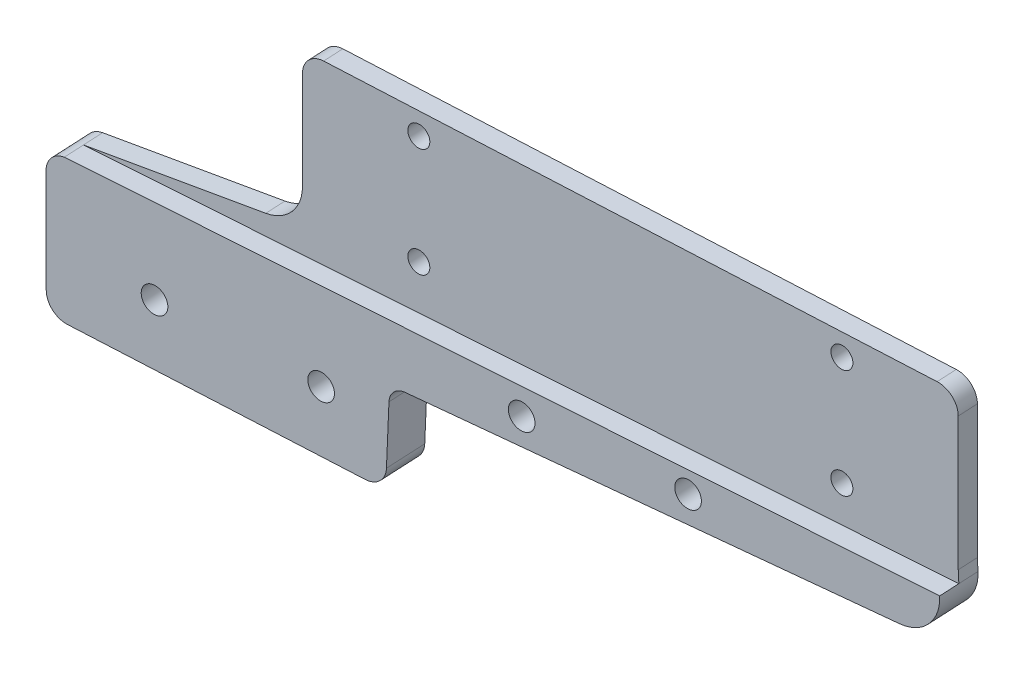
ISO-10303-21;
HEADER;
FILE_DESCRIPTION(('STEP AP214'),'2;1');
FILE_NAME('part.step','',(''),(''),'','','');
FILE_SCHEMA(('AUTOMOTIVE_DESIGN { 1 0 10303 214 1 1 1 1 }'));
ENDSEC;
DATA;
#1=APPLICATION_CONTEXT('core data for automotive mechanical design processes');
#2=APPLICATION_PROTOCOL_DEFINITION('international standard','automotive_design',2000,#1);
#3=PRODUCT_CONTEXT('',#1,'mechanical');
#4=PRODUCT('Part','Part','',(#3));
#5=PRODUCT_RELATED_PRODUCT_CATEGORY('part','',(#4));
#6=PRODUCT_DEFINITION_FORMATION('','',#4);
#7=PRODUCT_DEFINITION_CONTEXT('part definition',#1,'design');
#8=PRODUCT_DEFINITION('design','',#6,#7);
#9=PRODUCT_DEFINITION_SHAPE('','',#8);
#10=(LENGTH_UNIT() NAMED_UNIT(*) SI_UNIT(.MILLI.,.METRE.));
#11=(NAMED_UNIT(*) PLANE_ANGLE_UNIT() SI_UNIT($,.RADIAN.));
#12=(NAMED_UNIT(*) SI_UNIT($,.STERADIAN.) SOLID_ANGLE_UNIT());
#13=UNCERTAINTY_MEASURE_WITH_UNIT(LENGTH_MEASURE(1.E-05),#10,'distance_accuracy_value','');
#14=(GEOMETRIC_REPRESENTATION_CONTEXT(3) GLOBAL_UNCERTAINTY_ASSIGNED_CONTEXT((#13)) GLOBAL_UNIT_ASSIGNED_CONTEXT((#10,
#11,#12)) REPRESENTATION_CONTEXT('',''));
#15=CARTESIAN_POINT('',(0.,0.,0.));
#16=DIRECTION('',(0.,0.,1.));
#17=DIRECTION('',(1.,0.,0.));
#18=AXIS2_PLACEMENT_3D('',#15,#16,#17);
#19=CARTESIAN_POINT('',(23.0304524303552,-45.5135044544034,48.0957868389606));
#20=DIRECTION('',(-0.0496451578909029,0.,-0.9987669189045));
#21=DIRECTION('',(-0.9987669189045,0.,0.0496451578909029));
#22=AXIS2_PLACEMENT_3D('',#19,#20,#21);
#23=PLANE('',#22);
#24=CARTESIAN_POINT('',(-4.7239604871679,-38.0288662319544,49.4753601762225));
#25=DIRECTION('',(0.049645157890903,0.,0.9987669189045));
#26=DIRECTION('',(0.998658141309086,0.0147584526092087,-0.0496397509427982));
#27=AXIS2_PLACEMENT_3D('',#24,#25,#26);
#28=CIRCLE('',#27,3.29999975);
#29=CARTESIAN_POINT('',(-8.01953210382338,-38.0775691218753,49.6391713419236));
#30=VERTEX_POINT('',#29);
#31=EDGE_CURVE('E321',#30,#30,#28,.T.);
#32=ORIENTED_EDGE('',*,*,#31,.T.);
#33=EDGE_LOOP('',(#32));
#34=FACE_BOUND('',#33,.T.);
#35=CARTESIAN_POINT('',(-4.72396048717242,-3.73886623195444,49.4753601762225));
#36=DIRECTION('',(0.049645157890903,0.,0.9987669189045));
#37=DIRECTION('',(0.998658141309086,0.0147584526092074,-0.0496397509427982));
#38=AXIS2_PLACEMENT_3D('',#35,#36,#37);
#39=CIRCLE('',#38,3.29999975);
#40=CARTESIAN_POINT('',(-8.01953210382787,-3.78756912187521,49.6391713419238));
#41=VERTEX_POINT('',#40);
#42=EDGE_CURVE('E213',#41,#41,#39,.T.);
#43=ORIENTED_EDGE('',*,*,#42,.T.);
#44=EDGE_LOOP('',(#43));
#45=FACE_BOUND('',#44,.T.);
#46=CARTESIAN_POINT('',(122.119438213698,-38.0288662319437,43.1704251240779));
#47=DIRECTION('',(0.049645157890903,0.,0.9987669189045));
#48=DIRECTION('',(0.998658141309086,0.0147584526092084,-0.0496397509427982));
#49=AXIS2_PLACEMENT_3D('',#46,#47,#48);
#50=CIRCLE('',#49,3.29999975);
#51=CARTESIAN_POINT('',(118.823866597042,-38.0775691218644,43.3342362897793));
#52=VERTEX_POINT('',#51);
#53=EDGE_CURVE('E215',#52,#52,#50,.T.);
#54=ORIENTED_EDGE('',*,*,#53,.T.);
#55=EDGE_LOOP('',(#54));
#56=FACE_BOUND('',#55,.T.);
#57=CARTESIAN_POINT('',(122.119438213699,-3.7388662319316,43.1704251240779));
#58=DIRECTION('',(0.049645157890903,0.,0.9987669189045));
#59=DIRECTION('',(0.998658141309086,0.0147584526092087,-0.0496397509427982));
#60=AXIS2_PLACEMENT_3D('',#57,#58,#59);
#61=CIRCLE('',#60,3.29999975);
#62=CARTESIAN_POINT('',(118.823866597043,-3.78756912185237,43.3342362897793));
#63=VERTEX_POINT('',#62);
#64=EDGE_CURVE('E298',#63,#63,#61,.T.);
#65=ORIENTED_EDGE('',*,*,#64,.T.);
#66=EDGE_LOOP('',(#65));
#67=FACE_BOUND('',#66,.T.);
#68=CARTESIAN_POINT('',(81.7457238699355,-56.9150872381148,45.1772591363986));
#69=DIRECTION('',(0.0496451578909029,0.,0.9987669189045));
#70=DIRECTION('',(0.998748746819008,0.00603230557767858,-0.0496442546210445));
#71=AXIS2_PLACEMENT_3D('',#68,#69,#70);
#72=CIRCLE('',#71,4.0005);
#73=CARTESIAN_POINT('',(77.7502295082861,-56.9392194765781,45.3758609770102));
#74=VERTEX_POINT('',#73);
#75=EDGE_CURVE('E447',#74,#74,#72,.T.);
#76=ORIENTED_EDGE('',*,*,#75,.T.);
#77=EDGE_LOOP('',(#76));
#78=FACE_BOUND('',#77,.T.);
#79=CARTESIAN_POINT('',(-78.226896796319,-79.9764448286637,53.1289302028661));
#80=DIRECTION('',(0.049645157890903,0.,0.9987669189045));
#81=DIRECTION('',(0.997535358297987,0.049645157890903,-0.0495839413852246));
#82=AXIS2_PLACEMENT_3D('',#79,#80,#81);
#83=CIRCLE('',#82,4.0005);
#84=CARTESIAN_POINT('',(-82.21753699719,-80.1750502828063,53.3272907603776));
#85=VERTEX_POINT('',#84);
#86=EDGE_CURVE('E266',#85,#85,#83,.T.);
#87=ORIENTED_EDGE('',*,*,#86,.T.);
#88=EDGE_LOOP('',(#87));
#89=FACE_BOUND('',#88,.T.);
#90=CARTESIAN_POINT('',(-28.2760697725503,-79.8746910733802,50.6460519182148));
#91=DIRECTION('',(0.049645157890903,0.,0.9987669189045));
#92=DIRECTION('',(0.997535358297987,0.049645157890903,-0.0495839413852246));
#93=AXIS2_PLACEMENT_3D('',#90,#91,#92);
#94=CIRCLE('',#93,4.0005);
#95=CARTESIAN_POINT('',(-32.2667099734212,-80.0732965275228,50.8444124757263));
#96=VERTEX_POINT('',#95);
#97=EDGE_CURVE('E242',#96,#96,#94,.T.);
#98=ORIENTED_EDGE('',*,*,#97,.T.);
#99=EDGE_LOOP('',(#98));
#100=FACE_BOUND('',#99,.T.);
#101=CARTESIAN_POINT('',(31.8563870095215,-59.3979706616494,47.6570809633213));
#102=DIRECTION('',(0.0496451578909029,0.,0.9987669189045));
#103=DIRECTION('',(0.998748746819008,0.00603230557767854,-0.0496442546210445));
#104=AXIS2_PLACEMENT_3D('',#101,#102,#103);
#105=CIRCLE('',#104,4.0005);
#106=CARTESIAN_POINT('',(27.8608926478721,-59.4221029001128,47.8556828039329));
#107=VERTEX_POINT('',#106);
#108=EDGE_CURVE('E241',#107,#107,#105,.T.);
#109=ORIENTED_EDGE('',*,*,#108,.T.);
#110=EDGE_LOOP('',(#109));
#111=FACE_BOUND('',#110,.T.);
#112=DIRECTION('',(-0.0407531135449785,-0.999167193369499,0.00202569259973683));
#113=VECTOR('',#112,1.);
#114=CARTESIAN_POINT('',(-8.69104057488795,-92.8068316202381,49.6725496441483));
#115=LINE('',#114,#113);
#116=CARTESIAN_POINT('',(-7.93815013550859,-74.347789800056,49.6351261331867));
#117=VERTEX_POINT('',#116);
#118=CARTESIAN_POINT('',(-8.69104057488795,-92.8068316202381,49.6725496441483));
#119=VERTEX_POINT('',#118);
#120=EDGE_CURVE('E10',#117,#119,#115,.T.);
#121=ORIENTED_EDGE('',*,*,#120,.T.);
#122=CARTESIAN_POINT('',(-15.0279287087578,-92.5477298557401,49.9875338571697));
#123=DIRECTION('',(-0.0496451578909029,0.,-0.9987669189045));
#124=DIRECTION('',(0.997935139192111,-0.0408034274800349,-0.0496038130742391));
#125=AXIS2_PLACEMENT_3D('',#122,#123,#124);
#126=CIRCLE('',#125,6.35);
#127=CARTESIAN_POINT('',(-15.0150251682995,-98.8977167129911,49.9868924679813));
#128=VERTEX_POINT('',#127);
#129=EDGE_CURVE('E312',#119,#128,#126,.T.);
#130=ORIENTED_EDGE('',*,*,#129,.T.);
#131=DIRECTION('',(-0.998764851732424,-0.00203456239592946,0.0496450551391176));
#132=VECTOR('',#131,1.);
#133=CARTESIAN_POINT('',(-104.343240853185,-99.0796852997037,54.4270809522506));
#134=LINE('',#133,#132);
#135=CARTESIAN_POINT('',(-104.343240853185,-99.0796852997037,54.4270809522506));
#136=VERTEX_POINT('',#135);
#137=EDGE_CURVE('E349',#128,#136,#134,.T.);
#138=ORIENTED_EDGE('',*,*,#137,.T.);
#139=CARTESIAN_POINT('',(-104.356144393644,-92.7296984424527,54.427722341439));
#140=DIRECTION('',(-0.0496451578909029,0.,-0.9987669189045));
#141=DIRECTION('',(0.00203205361550425,-0.999997930275787,-0.000101006171384508));
#142=AXIS2_PLACEMENT_3D('',#139,#140,#141);
#143=CIRCLE('',#142,6.35);
#144=CARTESIAN_POINT('',(-110.698301202145,-92.7426179136668,54.7429684415724));
#145=VERTEX_POINT('',#144);
#146=EDGE_CURVE('E235',#136,#145,#143,.T.);
#147=ORIENTED_EDGE('',*,*,#146,.T.);
#148=DIRECTION('',(-0.00203205361550178,0.999997930275787,0.000101006171384386));
#149=VECTOR('',#148,1.);
#150=CARTESIAN_POINT('',(-110.764410892314,-60.2092473194499,54.7462545195796));
#151=LINE('',#150,#149);
#152=CARTESIAN_POINT('',(-110.764410892314,-60.2092473194499,54.7462545195796));
#153=VERTEX_POINT('',#152);
#154=EDGE_CURVE('E236',#145,#153,#151,.T.);
#155=ORIENTED_EDGE('',*,*,#154,.T.);
#156=CARTESIAN_POINT('',(-104.422254083813,-60.1963278482358,54.4310084194462));
#157=DIRECTION('',(-0.049645157890903,0.,-0.9987669189045));
#158=DIRECTION('',(-0.998764851732424,-0.00203456239592075,0.0496450551391176));
#159=AXIS2_PLACEMENT_3D('',#156,#157,#158);
#160=CIRCLE('',#159,6.35);
#161=CARTESIAN_POINT('',(-105.265370410465,-53.9026883167336,54.4729167389596));
#162=VERTEX_POINT('',#161);
#163=EDGE_CURVE('E253',#153,#162,#160,.T.);
#164=ORIENTED_EDGE('',*,*,#163,.T.);
#165=DIRECTION('',(0.98990219898805,0.132938148186988,-0.0492045241338364));
#166=VECTOR('',#165,1.);
#167=CARTESIAN_POINT('',(-50.6040023466961,-46.5619822801238,51.7558941817499));
#168=LINE('',#167,#166);
#169=CARTESIAN_POINT('',(-50.6040023466961,-46.5619822801238,51.7558941817499));
#170=VERTEX_POINT('',#169);
#171=EDGE_CURVE('E254',#162,#170,#168,.T.);
#172=ORIENTED_EDGE('',*,*,#171,.T.);
#173=CARTESIAN_POINT('',(-52.2902350000003,-33.9747032171193,51.8397108207769));
#174=DIRECTION('',(0.0496451578909029,0.,0.9987669189045));
#175=DIRECTION('',(0.9987669189045,0.,-0.0496451578909029));
#176=AXIS2_PLACEMENT_3D('',#173,#174,#175);
#177=CIRCLE('',#176,12.7);
#178=CARTESIAN_POINT('',(-39.6058951299132,-33.9747032171198,51.2092173155625));
#179=VERTEX_POINT('',#178);
#180=EDGE_CURVE('E296',#170,#179,#177,.T.);
#181=ORIENTED_EDGE('',*,*,#180,.T.);
#182=DIRECTION('',(0.,1.,0.));
#183=VECTOR('',#182,1.);
#184=CARTESIAN_POINT('',(-39.6058951299136,-45.085,51.2092173155625));
#185=LINE('',#184,#183);
#186=CARTESIAN_POINT('',(-39.6058951299122,-3.17499999999977,51.2092173155625));
#187=VERTEX_POINT('',#186);
#188=EDGE_CURVE('E297',#179,#187,#185,.T.);
#189=ORIENTED_EDGE('',*,*,#188,.T.);
#190=CARTESIAN_POINT('',(-33.2637251948684,-3.175,50.8939705629551));
#191=DIRECTION('',(-0.0496451578909029,0.,-0.9987669189045));
#192=DIRECTION('',(-0.9987669189045,0.,0.0496451578909029));
#193=AXIS2_PLACEMENT_3D('',#190,#191,#192);
#194=CIRCLE('',#193,6.35);
#195=CARTESIAN_POINT('',(-33.2637251948684,3.175,50.8939705629551));
#196=VERTEX_POINT('',#195);
#197=EDGE_CURVE('E348',#187,#196,#194,.T.);
#198=ORIENTED_EDGE('',*,*,#197,.T.);
#199=DIRECTION('',(0.9987669189045,0.,-0.049645157890903));
#200=VECTOR('',#199,1.);
#201=CARTESIAN_POINT('',(-33.2637251948684,3.175,50.8939705629551));
#202=LINE('',#201,#200);
#203=CARTESIAN_POINT('',(150.659202921395,3.175,41.7518147373452));
#204=VERTEX_POINT('',#203);
#205=EDGE_CURVE('E281',#196,#204,#202,.T.);
#206=ORIENTED_EDGE('',*,*,#205,.T.);
#207=CARTESIAN_POINT('',(150.659202921395,-3.175,41.7518147373452));
#208=DIRECTION('',(-0.0496451578909029,0.,-0.9987669189045));
#209=DIRECTION('',(0.,1.,0.));
#210=AXIS2_PLACEMENT_3D('',#207,#208,#209);
#211=CIRCLE('',#210,6.35);
#212=CARTESIAN_POINT('',(157.001372856439,-3.17500000000025,41.4365679847381));
#213=VERTEX_POINT('',#212);
#214=EDGE_CURVE('E247',#204,#213,#211,.T.);
#215=ORIENTED_EDGE('',*,*,#214,.T.);
#216=DIRECTION('',(0.,-1.,0.));
#217=VECTOR('',#216,1.);
#218=CARTESIAN_POINT('',(157.001372856439,-3.17500000000025,41.4365679847381));
#219=LINE('',#218,#217);
#220=CARTESIAN_POINT('',(157.001372856437,-45.0850000000348,41.4365679847381));
#221=VERTEX_POINT('',#220);
#222=EDGE_CURVE('E248',#213,#221,#219,.T.);
#223=ORIENTED_EDGE('',*,*,#222,.T.);
#224=DIRECTION('',(0.0495839413852198,-0.9987669189045,-0.002464641702012));
#225=VECTOR('',#224,1.);
#226=CARTESIAN_POINT('',(157.001372856437,-45.0850000000348,41.4365679847381));
#227=LINE('',#226,#225);
#228=CARTESIAN_POINT('',(157.185188532275,-48.787590215232,41.4274311600426));
#229=VERTEX_POINT('',#228);
#230=EDGE_CURVE('E360',#221,#229,#227,.T.);
#231=ORIENTED_EDGE('',*,*,#230,.T.);
#232=CARTESIAN_POINT('',(144.516489481891,-49.4180837204464,42.0571472156349));
#233=DIRECTION('',(-0.049645157890903,0.,-0.9987669189045));
#234=DIRECTION('',(0.997535358297987,0.0496451578909028,-0.0495839413852246));
#235=AXIS2_PLACEMENT_3D('',#232,#233,#234);
#236=CIRCLE('',#235,12.7);
#237=CARTESIAN_POINT('',(145.146205537484,-62.1024235905336,42.0258462660195));
#238=VERTEX_POINT('',#237);
#239=EDGE_CURVE('E282',#229,#238,#236,.T.);
#240=ORIENTED_EDGE('',*,*,#239,.T.);
#241=DIRECTION('',(-0.997535358297987,-0.0496451578909023,0.0495839413852246));
#242=VECTOR('',#241,1.);
#243=CARTESIAN_POINT('',(145.146205537484,-62.1024235905336,42.0258462660195));
#244=LINE('',#243,#242);
#245=CARTESIAN_POINT('',(-3.12052605064964,-69.4813352636195,49.395659142616));
#246=VERTEX_POINT('',#245);
#247=EDGE_CURVE('E318',#238,#246,#244,.T.);
#248=ORIENTED_EDGE('',*,*,#247,.T.);
#249=CARTESIAN_POINT('',(-2.86863962841267,-74.5550712116544,49.3831387627695));
#250=DIRECTION('',(0.0496451578909029,0.,0.9987669189045));
#251=DIRECTION('',(-0.997935139192111,0.0408034274800353,0.0496038130742391));
#252=AXIS2_PLACEMENT_3D('',#249,#250,#251);
#253=CIRCLE('',#252,5.08);
#254=EDGE_CURVE('E322',#246,#117,#253,.T.);
#255=ORIENTED_EDGE('',*,*,#254,.T.);
#256=EDGE_LOOP('',(#121,#130,#138,#147,#155,#164,#172,#181,#189,#198,#206,#215,#223,#231,#240,
#248,#255));
#257=FACE_BOUND('',#256,.T.);
#258=ADVANCED_FACE('F15',(#34,#45,#56,#67,#78,#89,#100,#111,#257),#23,.T.);
#259=CARTESIAN_POINT('',(-7.62290338290138,-74.347789800056,55.9772960682304));
#260=DIRECTION('',(0.997935139192111,-0.0408034274800358,-0.0496038130742391));
#261=DIRECTION('',(0.,-0.772287452846569,0.63527324056327));
#262=AXIS2_PLACEMENT_3D('',#259,#260,#261);
#263=PLANE('',#262);
#264=DIRECTION('',(-0.0496451578909029,0.,-0.9987669189045));
#265=VECTOR('',#264,1.);
#266=CARTESIAN_POINT('',(-8.37579382228073,-92.8068316202381,56.0147195791918));
#267=LINE('',#266,#265);
#268=CARTESIAN_POINT('',(-8.06054706967349,-92.8068316202381,62.3568895142355));
#269=VERTEX_POINT('',#268);
#270=EDGE_CURVE('E26',#269,#119,#267,.T.);
#271=ORIENTED_EDGE('',*,*,#270,.T.);
#272=ORIENTED_EDGE('',*,*,#120,.F.);
#273=DIRECTION('',(0.0496451578909029,0.,0.9987669189045));
#274=VECTOR('',#273,1.);
#275=CARTESIAN_POINT('',(-7.62290338290138,-74.347789800056,55.9772960682304));
#276=LINE('',#275,#274);
#277=CARTESIAN_POINT('',(-7.30765663029414,-74.347789800056,62.3194660032739));
#278=VERTEX_POINT('',#277);
#279=EDGE_CURVE('E326',#117,#278,#276,.T.);
#280=ORIENTED_EDGE('',*,*,#279,.T.);
#281=DIRECTION('',(0.0407531135449785,0.999167193369499,-0.00202569259973683));
#282=VECTOR('',#281,1.);
#283=CARTESIAN_POINT('',(-8.06054706967349,-92.8068316202381,62.3568895142355));
#284=LINE('',#283,#282);
#285=EDGE_CURVE('E399',#269,#278,#284,.T.);
#286=ORIENTED_EDGE('',*,*,#285,.F.);
#287=EDGE_LOOP('',(#271,#272,#280,#286));
#288=FACE_BOUND('',#287,.T.);
#289=ADVANCED_FACE('F547',(#288),#263,.T.);
#290=CARTESIAN_POINT('',(-14.7126819561506,-92.5477298557401,56.3297037922132));
#291=DIRECTION('',(-0.0496451578909029,0.,-0.9987669189045));
#292=DIRECTION('',(0.997935139192111,-0.0408034274800349,-0.0496038130742391));
#293=AXIS2_PLACEMENT_3D('',#290,#291,#292);
#294=CYLINDRICAL_SURFACE('',#293,6.35);
#295=DIRECTION('',(-0.0496451578909029,0.,-0.9987669189045));
#296=VECTOR('',#295,1.);
#297=CARTESIAN_POINT('',(-14.6997784156922,-98.8977167129911,56.329062403025));
#298=LINE('',#297,#296);
#299=CARTESIAN_POINT('',(-14.384531663085,-98.8977167129911,62.6712323380685));
#300=VERTEX_POINT('',#299);
#301=EDGE_CURVE('E352',#300,#128,#298,.T.);
#302=ORIENTED_EDGE('',*,*,#301,.T.);
#303=ORIENTED_EDGE('',*,*,#129,.F.);
#304=ORIENTED_EDGE('',*,*,#270,.F.);
#305=CARTESIAN_POINT('',(-14.3974352035434,-92.5477298557401,62.6718737272569));
#306=DIRECTION('',(0.0496451578909029,0.,0.9987669189045));
#307=DIRECTION('',(0.997935139192111,-0.0408034274800349,-0.0496038130742391));
#308=AXIS2_PLACEMENT_3D('',#305,#306,#307);
#309=CIRCLE('',#308,6.35);
#310=EDGE_CURVE('E354',#300,#269,#309,.T.);
#311=ORIENTED_EDGE('',*,*,#310,.F.);
#312=EDGE_LOOP('',(#302,#303,#304,#311));
#313=FACE_BOUND('',#312,.T.);
#314=ADVANCED_FACE('F548',(#313),#294,.T.);
#315=CARTESIAN_POINT('',(-14.6997784156922,-98.8977167129911,56.329062403025));
#316=DIRECTION('',(0.00203205361550144,-0.999997930275787,-0.000101006171384369));
#317=DIRECTION('',(0.,0.000101006379924472,-0.999999994898856));
#318=AXIS2_PLACEMENT_3D('',#315,#316,#317);
#319=PLANE('',#318);
#320=DIRECTION('',(-0.0496451578909029,0.,-0.9987669189045));
#321=VECTOR('',#320,1.);
#322=CARTESIAN_POINT('',(-104.027994100578,-99.0796852997037,60.7692508872943));
#323=LINE('',#322,#321);
#324=CARTESIAN_POINT('',(-103.712747347971,-99.0796852997037,67.1114208223377));
#325=VERTEX_POINT('',#324);
#326=EDGE_CURVE('E353',#325,#136,#323,.T.);
#327=ORIENTED_EDGE('',*,*,#326,.T.);
#328=ORIENTED_EDGE('',*,*,#137,.F.);
#329=ORIENTED_EDGE('',*,*,#301,.F.);
#330=DIRECTION('',(0.998764851732424,0.00203456239592946,-0.0496450551391176));
#331=VECTOR('',#330,1.);
#332=CARTESIAN_POINT('',(-103.712747347971,-99.0796852997037,67.1114208223377));
#333=LINE('',#332,#331);
#334=EDGE_CURVE('E339',#325,#300,#333,.T.);
#335=ORIENTED_EDGE('',*,*,#334,.F.);
#336=EDGE_LOOP('',(#327,#328,#329,#335));
#337=FACE_BOUND('',#336,.T.);
#338=ADVANCED_FACE('F490',(#337),#319,.T.);
#339=CARTESIAN_POINT('',(-104.040897641037,-92.7296984424527,60.7698922764824));
#340=DIRECTION('',(-0.0496451578909029,0.,-0.9987669189045));
#341=DIRECTION('',(0.00203205361550425,-0.999997930275787,-0.000101006171384508));
#342=AXIS2_PLACEMENT_3D('',#339,#340,#341);
#343=CYLINDRICAL_SURFACE('',#342,6.35);
#344=DIRECTION('',(-0.0496451578909029,0.,-0.9987669189045));
#345=VECTOR('',#344,1.);
#346=CARTESIAN_POINT('',(-110.383054449538,-92.7426179136668,61.0851383766158));
#347=LINE('',#346,#345);
#348=CARTESIAN_POINT('',(-110.06780769693,-92.7426179136668,67.4273083116595));
#349=VERTEX_POINT('',#348);
#350=EDGE_CURVE('E231',#349,#145,#347,.T.);
#351=ORIENTED_EDGE('',*,*,#350,.T.);
#352=ORIENTED_EDGE('',*,*,#146,.F.);
#353=ORIENTED_EDGE('',*,*,#326,.F.);
#354=CARTESIAN_POINT('',(-103.72565088843,-92.7296984424527,67.1120622115261));
#355=DIRECTION('',(0.0496451578909029,0.,0.9987669189045));
#356=DIRECTION('',(0.00203205361550425,-0.999997930275787,-0.000101006171384508));
#357=AXIS2_PLACEMENT_3D('',#354,#355,#356);
#358=CIRCLE('',#357,6.35);
#359=EDGE_CURVE('E335',#349,#325,#358,.T.);
#360=ORIENTED_EDGE('',*,*,#359,.F.);
#361=EDGE_LOOP('',(#351,#352,#353,#360));
#362=FACE_BOUND('',#361,.T.);
#363=ADVANCED_FACE('F493',(#362),#343,.T.);
#364=CARTESIAN_POINT('',(-110.383054449538,-92.7426179136668,61.0851383766158));
#365=DIRECTION('',(-0.998764851732424,-0.0020345623959298,0.0496450551391176));
#366=DIRECTION('',(-0.0020370742632898,0.99999792516207,0.));
#367=AXIS2_PLACEMENT_3D('',#364,#365,#366);
#368=PLANE('',#367);
#369=DIRECTION('',(-0.0496451578909029,0.,-0.9987669189045));
#370=VECTOR('',#369,1.);
#371=CARTESIAN_POINT('',(-110.449164139707,-60.2092473194499,61.088424454623));
#372=LINE('',#371,#370);
#373=CARTESIAN_POINT('',(-110.1339173871,-60.2092473194499,67.4305943896667));
#374=VERTEX_POINT('',#373);
#375=EDGE_CURVE('E331',#374,#153,#372,.T.);
#376=ORIENTED_EDGE('',*,*,#375,.T.);
#377=ORIENTED_EDGE('',*,*,#154,.F.);
#378=ORIENTED_EDGE('',*,*,#350,.F.);
#379=DIRECTION('',(0.00203205361550181,-0.999997930275787,-0.000101006171384387));
#380=VECTOR('',#379,1.);
#381=CARTESIAN_POINT('',(-110.1339173871,-60.2092473194499,67.4305943896667));
#382=LINE('',#381,#380);
#383=EDGE_CURVE('E259',#374,#349,#382,.T.);
#384=ORIENTED_EDGE('',*,*,#383,.F.);
#385=EDGE_LOOP('',(#376,#377,#378,#384));
#386=FACE_BOUND('',#385,.T.);
#387=ADVANCED_FACE('F549',(#386),#368,.T.);
#388=CARTESIAN_POINT('',(-104.107007331206,-60.1963278482358,60.7731783544896));
#389=DIRECTION('',(-0.049645157890903,0.,-0.9987669189045));
#390=DIRECTION('',(-0.998764851732424,-0.00203456239592075,0.0496450551391176));
#391=AXIS2_PLACEMENT_3D('',#388,#389,#390);
#392=CYLINDRICAL_SURFACE('',#391,6.35);
#393=DIRECTION('',(-0.0496451578909029,0.,-0.9987669189045));
#394=VECTOR('',#393,1.);
#395=CARTESIAN_POINT('',(-104.950123657858,-53.9026883167336,60.8150866740033));
#396=LINE('',#395,#394);
#397=CARTESIAN_POINT('',(-104.950123657858,-53.9026883167336,60.8150866740033));
#398=VERTEX_POINT('',#397);
#399=EDGE_CURVE('E249',#398,#162,#396,.T.);
#400=ORIENTED_EDGE('',*,*,#399,.T.);
#401=ORIENTED_EDGE('',*,*,#163,.F.);
#402=ORIENTED_EDGE('',*,*,#375,.F.);
#403=CARTESIAN_POINT('',(-103.791760578599,-60.1963278482358,67.1153482895333));
#404=DIRECTION('',(0.049645157890903,0.,0.9987669189045));
#405=DIRECTION('',(-0.998764851732424,-0.00203456239592093,0.0496450551391176));
#406=AXIS2_PLACEMENT_3D('',#403,#404,#405);
#407=CIRCLE('',#406,6.35);
#408=CARTESIAN_POINT('',(-104.634876905251,-53.9026883167336,67.1572566090467));
#409=VERTEX_POINT('',#408);
#410=EDGE_CURVE('E255',#409,#374,#407,.T.);
#411=ORIENTED_EDGE('',*,*,#410,.F.);
#412=DIRECTION('',(0.0496451578909029,0.,0.9987669189045));
#413=VECTOR('',#412,1.);
#414=CARTESIAN_POINT('',(-104.950123657858,-53.9026883167336,60.8150866740033));
#415=LINE('',#414,#413);
#416=EDGE_CURVE('E364',#398,#409,#415,.T.);
#417=ORIENTED_EDGE('',*,*,#416,.F.);
#418=EDGE_LOOP('',(#400,#401,#402,#411,#417));
#419=FACE_BOUND('',#418,.T.);
#420=ADVANCED_FACE('F550',(#419),#392,.T.);
#421=CARTESIAN_POINT('',(-104.950123657858,-53.9026883167336,60.8150866740033));
#422=DIRECTION('',(-0.132774224669588,0.991124335669655,0.00659973535646685));
#423=DIRECTION('',(0.0496451578908997,0.,0.9987669189045));
#424=AXIS2_PLACEMENT_3D('',#421,#422,#423);
#425=PLANE('',#424);
#426=DIRECTION('',(-0.98990219898805,-0.132938148186988,0.0492045241338364));
#427=VECTOR('',#426,1.);
#428=CARTESIAN_POINT('',(-50.2887555940888,-46.5619822801238,58.0980641167933));
#429=LINE('',#428,#427);
#430=CARTESIAN_POINT('',(-50.2887555940888,-46.5619822801238,58.0980641167933));
#431=VERTEX_POINT('',#430);
#432=EDGE_CURVE('E276',#431,#398,#429,.T.);
#433=ORIENTED_EDGE('',*,*,#432,.F.);
#434=DIRECTION('',(-0.0496451578909029,0.,-0.9987669189045));
#435=VECTOR('',#434,1.);
#436=CARTESIAN_POINT('',(-50.2887555940888,-46.5619822801238,58.0980641167933));
#437=LINE('',#436,#435);
#438=EDGE_CURVE('E378',#431,#170,#437,.T.);
#439=ORIENTED_EDGE('',*,*,#438,.T.);
#440=ORIENTED_EDGE('',*,*,#171,.F.);
#441=ORIENTED_EDGE('',*,*,#399,.F.);
#442=EDGE_LOOP('',(#433,#439,#440,#441));
#443=FACE_BOUND('',#442,.T.);
#444=ADVANCED_FACE('F557',(#443),#425,.T.);
#445=CARTESIAN_POINT('',(-51.974988247393,-33.9747032171193,58.1818807558203));
#446=DIRECTION('',(-0.0496451578909029,0.,-0.9987669189045));
#447=DIRECTION('',(0.9987669189045,0.,-0.0496451578909029));
#448=AXIS2_PLACEMENT_3D('',#445,#446,#447);
#449=CYLINDRICAL_SURFACE('',#448,12.7);
#450=CARTESIAN_POINT('',(-51.974988247393,-33.9747032171193,58.1818807558203));
#451=DIRECTION('',(-0.0496451578909029,0.,-0.9987669189045));
#452=DIRECTION('',(0.9987669189045,0.,-0.0496451578909029));
#453=AXIS2_PLACEMENT_3D('',#450,#451,#452);
#454=CIRCLE('',#453,12.7);
#455=CARTESIAN_POINT('',(-39.2906483773058,-33.9747032171198,57.5513872506059));
#456=VERTEX_POINT('',#455);
#457=EDGE_CURVE('E343',#456,#431,#454,.T.);
#458=ORIENTED_EDGE('',*,*,#457,.F.);
#459=DIRECTION('',(-0.0496451578909029,0.,-0.9987669189045));
#460=VECTOR('',#459,1.);
#461=CARTESIAN_POINT('',(-39.2906483773058,-33.9747032171198,57.5513872506059));
#462=LINE('',#461,#460);
#463=EDGE_CURVE('E292',#456,#179,#462,.T.);
#464=ORIENTED_EDGE('',*,*,#463,.T.);
#465=ORIENTED_EDGE('',*,*,#180,.F.);
#466=ORIENTED_EDGE('',*,*,#438,.F.);
#467=EDGE_LOOP('',(#458,#464,#465,#466));
#468=FACE_BOUND('',#467,.T.);
#469=ADVANCED_FACE('F560',(#468),#449,.F.);
#470=CARTESIAN_POINT('',(-39.290648377306,-33.9747032171198,57.5513872506059));
#471=DIRECTION('',(-0.9987669189045,0.,0.0496451578909029));
#472=DIRECTION('',(0.,1.,0.));
#473=AXIS2_PLACEMENT_3D('',#470,#471,#472);
#474=PLANE('',#473);
#475=DIRECTION('',(0.,1.,0.));
#476=VECTOR('',#475,1.);
#477=CARTESIAN_POINT('',(-39.2906483773066,-45.085,57.5513872506059));
#478=LINE('',#477,#476);
#479=CARTESIAN_POINT('',(-39.2906483773048,-3.17499999999977,57.5513872506059));
#480=VERTEX_POINT('',#479);
#481=EDGE_CURVE('E429',#456,#480,#478,.T.);
#482=ORIENTED_EDGE('',*,*,#481,.T.);
#483=DIRECTION('',(-0.0496451578909029,0.,-0.9987669189045));
#484=VECTOR('',#483,1.);
#485=CARTESIAN_POINT('',(-39.2906483773048,-3.17499999999977,57.5513872506059));
#486=LINE('',#485,#484);
#487=EDGE_CURVE('E422',#480,#187,#486,.T.);
#488=ORIENTED_EDGE('',*,*,#487,.T.);
#489=ORIENTED_EDGE('',*,*,#188,.F.);
#490=ORIENTED_EDGE('',*,*,#463,.F.);
#491=EDGE_LOOP('',(#482,#488,#489,#490));
#492=FACE_BOUND('',#491,.T.);
#493=ADVANCED_FACE('F565',(#492),#474,.T.);
#494=CARTESIAN_POINT('',(-32.9484784422613,-3.175,57.2361404979986));
#495=DIRECTION('',(-0.0496451578909029,0.,-0.9987669189045));
#496=DIRECTION('',(-0.9987669189045,0.,0.0496451578909029));
#497=AXIS2_PLACEMENT_3D('',#494,#495,#496);
#498=CYLINDRICAL_SURFACE('',#497,6.35);
#499=CARTESIAN_POINT('',(-32.9484784422613,-3.175,57.2361404979986));
#500=DIRECTION('',(-0.0496451578909029,0.,-0.9987669189045));
#501=DIRECTION('',(-0.9987669189045,0.,0.0496451578909029));
#502=AXIS2_PLACEMENT_3D('',#499,#500,#501);
#503=CIRCLE('',#502,6.35);
#504=CARTESIAN_POINT('',(-32.9484784422613,3.175,57.2361404979986));
#505=VERTEX_POINT('',#504);
#506=EDGE_CURVE('E19',#480,#505,#503,.T.);
#507=ORIENTED_EDGE('',*,*,#506,.T.);
#508=DIRECTION('',(-0.0496451578909029,0.,-0.9987669189045));
#509=VECTOR('',#508,1.);
#510=CARTESIAN_POINT('',(-32.9484784422613,3.175,57.2361404979986));
#511=LINE('',#510,#509);
#512=EDGE_CURVE('E344',#505,#196,#511,.T.);
#513=ORIENTED_EDGE('',*,*,#512,.T.);
#514=ORIENTED_EDGE('',*,*,#197,.F.);
#515=ORIENTED_EDGE('',*,*,#487,.F.);
#516=EDGE_LOOP('',(#507,#513,#514,#515));
#517=FACE_BOUND('',#516,.T.);
#518=ADVANCED_FACE('F571',(#517),#498,.T.);
#519=CARTESIAN_POINT('',(-32.9484784422613,3.175,57.2361404979986));
#520=DIRECTION('',(0.,1.,0.));
#521=DIRECTION('',(0.,0.,-1.));
#522=AXIS2_PLACEMENT_3D('',#519,#520,#521);
#523=PLANE('',#522);
#524=DIRECTION('',(0.9987669189045,0.,-0.049645157890903));
#525=VECTOR('',#524,1.);
#526=CARTESIAN_POINT('',(-32.9484784422613,3.175,57.2361404979986));
#527=LINE('',#526,#525);
#528=CARTESIAN_POINT('',(150.974449674002,3.175,48.093984672389));
#529=VERTEX_POINT('',#528);
#530=EDGE_CURVE('E578',#505,#529,#527,.T.);
#531=ORIENTED_EDGE('',*,*,#530,.T.);
#532=DIRECTION('',(-0.0496451578909029,0.,-0.9987669189045));
#533=VECTOR('',#532,1.);
#534=CARTESIAN_POINT('',(150.974449674002,3.175,48.093984672389));
#535=LINE('',#534,#533);
#536=EDGE_CURVE('E277',#529,#204,#535,.T.);
#537=ORIENTED_EDGE('',*,*,#536,.T.);
#538=ORIENTED_EDGE('',*,*,#205,.F.);
#539=ORIENTED_EDGE('',*,*,#512,.F.);
#540=EDGE_LOOP('',(#531,#537,#538,#539));
#541=FACE_BOUND('',#540,.T.);
#542=ADVANCED_FACE('F576',(#541),#523,.T.);
#543=CARTESIAN_POINT('',(150.974449674002,-3.175,48.093984672389));
#544=DIRECTION('',(-0.0496451578909029,0.,-0.9987669189045));
#545=DIRECTION('',(0.,1.,0.));
#546=AXIS2_PLACEMENT_3D('',#543,#544,#545);
#547=CYLINDRICAL_SURFACE('',#546,6.35);
#548=CARTESIAN_POINT('',(150.974449674002,-3.175,48.093984672389));
#549=DIRECTION('',(-0.0496451578909029,0.,-0.9987669189045));
#550=DIRECTION('',(0.,1.,0.));
#551=AXIS2_PLACEMENT_3D('',#548,#549,#550);
#552=CIRCLE('',#551,6.35);
#553=CARTESIAN_POINT('',(157.316619609046,-3.17500000000025,47.7787379197816));
#554=VERTEX_POINT('',#553);
#555=EDGE_CURVE('E264',#529,#554,#552,.T.);
#556=ORIENTED_EDGE('',*,*,#555,.T.);
#557=DIRECTION('',(-0.0496451578909029,0.,-0.9987669189045));
#558=VECTOR('',#557,1.);
#559=CARTESIAN_POINT('',(157.316619609046,-3.17500000000025,47.7787379197816));
#560=LINE('',#559,#558);
#561=EDGE_CURVE('E243',#554,#213,#560,.T.);
#562=ORIENTED_EDGE('',*,*,#561,.T.);
#563=ORIENTED_EDGE('',*,*,#214,.F.);
#564=ORIENTED_EDGE('',*,*,#536,.F.);
#565=EDGE_LOOP('',(#556,#562,#563,#564));
#566=FACE_BOUND('',#565,.T.);
#567=ADVANCED_FACE('F582',(#566),#547,.T.);
#568=CARTESIAN_POINT('',(157.316619609046,-3.17500000000025,47.7787379197816));
#569=DIRECTION('',(0.9987669189045,0.,-0.049645157890903));
#570=DIRECTION('',(0.,-1.,8.24781603413122E-13));
#571=AXIS2_PLACEMENT_3D('',#568,#569,#570);
#572=PLANE('',#571);
#573=DIRECTION('',(0.,-1.,0.));
#574=VECTOR('',#573,1.);
#575=CARTESIAN_POINT('',(157.316619609046,-3.17500000000025,47.7787379197816));
#576=LINE('',#575,#574);
#577=CARTESIAN_POINT('',(157.316619609044,-45.0850000000348,47.7787379197819));
#578=VERTEX_POINT('',#577);
#579=EDGE_CURVE('E260',#554,#578,#576,.T.);
#580=ORIENTED_EDGE('',*,*,#579,.T.);
#581=DIRECTION('',(-0.0496451578909029,0.,-0.9987669189045));
#582=VECTOR('',#581,1.);
#583=CARTESIAN_POINT('',(157.316619609044,-45.0850000000348,47.7787379197819));
#584=LINE('',#583,#582);
#585=EDGE_CURVE('E330',#578,#221,#584,.T.);
#586=ORIENTED_EDGE('',*,*,#585,.T.);
#587=ORIENTED_EDGE('',*,*,#222,.F.);
#588=ORIENTED_EDGE('',*,*,#561,.F.);
#589=EDGE_LOOP('',(#580,#586,#587,#588));
#590=FACE_BOUND('',#589,.T.);
#591=ADVANCED_FACE('F17',(#590),#572,.T.);
#592=CARTESIAN_POINT('',(157.316619609044,-45.0850000000348,47.7787379197819));
#593=DIRECTION('',(0.997535358297988,0.0496451578908982,-0.0495839413852246));
#594=DIRECTION('',(0.,-0.706670417755222,-0.707542875499188));
#595=AXIS2_PLACEMENT_3D('',#592,#593,#594);
#596=PLANE('',#595);
#597=DIRECTION('',(0.0495839413852198,-0.9987669189045,-0.002464641702012));
#598=VECTOR('',#597,1.);
#599=CARTESIAN_POINT('',(157.316619609044,-45.0850000000348,47.7787379197819));
#600=LINE('',#599,#598);
#601=CARTESIAN_POINT('',(157.500435284883,-48.787590215232,47.769601095086));
#602=VERTEX_POINT('',#601);
#603=EDGE_CURVE('E265',#578,#602,#600,.T.);
#604=ORIENTED_EDGE('',*,*,#603,.T.);
#605=DIRECTION('',(-0.0496451578909029,0.,-0.9987669189045));
#606=VECTOR('',#605,1.);
#607=CARTESIAN_POINT('',(157.500435284883,-48.787590215232,47.769601095086));
#608=LINE('',#607,#606);
#609=EDGE_CURVE('E285',#602,#229,#608,.T.);
#610=ORIENTED_EDGE('',*,*,#609,.T.);
#611=ORIENTED_EDGE('',*,*,#230,.F.);
#612=ORIENTED_EDGE('',*,*,#585,.F.);
#613=EDGE_LOOP('',(#604,#610,#611,#612));
#614=FACE_BOUND('',#613,.T.);
#615=ADVANCED_FACE('F590',(#614),#596,.T.);
#616=CARTESIAN_POINT('',(144.831736234498,-49.4180837204464,48.3993171506786));
#617=DIRECTION('',(-0.049645157890903,0.,-0.9987669189045));
#618=DIRECTION('',(0.997535358297987,0.0496451578909028,-0.0495839413852246));
#619=AXIS2_PLACEMENT_3D('',#616,#617,#618);
#620=CYLINDRICAL_SURFACE('',#619,12.7);
#621=DIRECTION('',(-0.0496451578909029,0.,-0.9987669189045));
#622=VECTOR('',#621,1.);
#623=CARTESIAN_POINT('',(145.461452290091,-62.1024235905336,48.3680162010629));
#624=LINE('',#623,#622);
#625=CARTESIAN_POINT('',(145.776699042698,-62.1024235905336,54.7101861361064));
#626=VERTEX_POINT('',#625);
#627=EDGE_CURVE('E286',#626,#238,#624,.T.);
#628=ORIENTED_EDGE('',*,*,#627,.T.);
#629=ORIENTED_EDGE('',*,*,#239,.F.);
#630=ORIENTED_EDGE('',*,*,#609,.F.);
#631=DIRECTION('',(0.0496451578909029,0.,0.9987669189045));
#632=VECTOR('',#631,1.);
#633=CARTESIAN_POINT('',(157.500435284883,-48.787590215232,47.769601095086));
#634=LINE('',#633,#632);
#635=CARTESIAN_POINT('',(157.81568203749,-48.7875902152317,54.1117710301297));
#636=VERTEX_POINT('',#635);
#637=EDGE_CURVE('E470',#602,#636,#634,.T.);
#638=ORIENTED_EDGE('',*,*,#637,.T.);
#639=CARTESIAN_POINT('',(145.146982987106,-49.4180837204464,54.741487085722));
#640=DIRECTION('',(0.049645157890903,0.,0.9987669189045));
#641=DIRECTION('',(0.997535358297987,0.049645157890903,-0.0495839413852246));
#642=AXIS2_PLACEMENT_3D('',#639,#640,#641);
#643=CIRCLE('',#642,12.7);
#644=EDGE_CURVE('E198',#626,#636,#643,.T.);
#645=ORIENTED_EDGE('',*,*,#644,.F.);
#646=EDGE_LOOP('',(#628,#629,#630,#638,#645));
#647=FACE_BOUND('',#646,.T.);
#648=ADVANCED_FACE('F593',(#647),#620,.T.);
#649=CARTESIAN_POINT('',(145.461452290091,-62.1024235905336,48.3680162010629));
#650=DIRECTION('',(0.0495839413852239,-0.9987669189045,-0.00246464170201221));
#651=DIRECTION('',(0.,0.00246767704378172,-0.999996955280369));
#652=AXIS2_PLACEMENT_3D('',#649,#650,#651);
#653=PLANE('',#652);
#654=DIRECTION('',(-0.0496451578909029,0.,-0.9987669189045));
#655=VECTOR('',#654,1.);
#656=CARTESIAN_POINT('',(-2.8052792980424,-69.4813352636195,55.7378290776594));
#657=LINE('',#656,#655);
#658=CARTESIAN_POINT('',(-2.49003254543517,-69.4813352636195,62.0799990127031));
#659=VERTEX_POINT('',#658);
#660=EDGE_CURVE('E325',#659,#246,#657,.T.);
#661=ORIENTED_EDGE('',*,*,#660,.T.);
#662=ORIENTED_EDGE('',*,*,#247,.F.);
#663=ORIENTED_EDGE('',*,*,#627,.F.);
#664=DIRECTION('',(0.997535358297987,0.0496451578909037,-0.0495839413852246));
#665=VECTOR('',#664,1.);
#666=CARTESIAN_POINT('',(145.776699042698,-62.1024235905336,54.7101861361064));
#667=LINE('',#666,#665);
#668=EDGE_CURVE('E386',#659,#626,#667,.T.);
#669=ORIENTED_EDGE('',*,*,#668,.F.);
#670=EDGE_LOOP('',(#661,#662,#663,#669));
#671=FACE_BOUND('',#670,.T.);
#672=ADVANCED_FACE('F543',(#671),#653,.T.);
#673=CARTESIAN_POINT('',(-2.55339287580545,-74.5550712116544,55.7253086978132));
#674=DIRECTION('',(-0.0496451578909029,0.,-0.9987669189045));
#675=DIRECTION('',(-0.997935139192111,0.0408034274800353,0.0496038130742391));
#676=AXIS2_PLACEMENT_3D('',#673,#674,#675);
#677=CYLINDRICAL_SURFACE('',#676,5.08);
#678=ORIENTED_EDGE('',*,*,#279,.F.);
#679=ORIENTED_EDGE('',*,*,#254,.F.);
#680=ORIENTED_EDGE('',*,*,#660,.F.);
#681=CARTESIAN_POINT('',(-2.23814612319822,-74.5550712116544,62.0674786328567));
#682=DIRECTION('',(-0.0496451578909029,0.,-0.9987669189045));
#683=DIRECTION('',(-0.997935139192111,0.0408034274800353,0.0496038130742391));
#684=AXIS2_PLACEMENT_3D('',#681,#682,#683);
#685=CIRCLE('',#684,5.08);
#686=EDGE_CURVE('E389',#278,#659,#685,.T.);
#687=ORIENTED_EDGE('',*,*,#686,.F.);
#688=EDGE_LOOP('',(#678,#679,#680,#687));
#689=FACE_BOUND('',#688,.T.);
#690=ADVANCED_FACE('F545',(#689),#677,.F.);
#691=CARTESIAN_POINT('',(32.1716337621288,-59.3979706616494,53.999250898365));
#692=DIRECTION('',(-0.0496451578909029,0.,-0.9987669189045));
#693=DIRECTION('',(0.998748746819008,0.00603230557767854,-0.0496442546210445));
#694=AXIS2_PLACEMENT_3D('',#691,#692,#693);
#695=CYLINDRICAL_SURFACE('',#694,4.0005);
#696=ORIENTED_EDGE('',*,*,#108,.F.);
#697=DIRECTION('',(0.0496451578909029,0.,0.9987669189045));
#698=VECTOR('',#697,1.);
#699=CARTESIAN_POINT('',(28.1761394004794,-59.4221029001128,54.1978527389764));
#700=LINE('',#699,#698);
#701=CARTESIAN_POINT('',(28.4913861530865,-59.4221029001128,60.5400226740201));
#702=VERTEX_POINT('',#701);
#703=EDGE_CURVE('E385',#107,#702,#700,.T.);
#704=ORIENTED_EDGE('',*,*,#703,.T.);
#705=CARTESIAN_POINT('',(32.4868805147361,-59.3979706616494,60.3414208334085));
#706=DIRECTION('',(-0.049645157890903,0.,-0.9987669189045));
#707=DIRECTION('',(0.997535358297987,0.049645157890903,-0.0495839413852246));
#708=AXIS2_PLACEMENT_3D('',#705,#706,#707);
#709=CIRCLE('',#708,4.0005);
#710=EDGE_CURVE('E287',#702,#702,#709,.T.);
#711=ORIENTED_EDGE('',*,*,#710,.F.);
#712=ORIENTED_EDGE('',*,*,#703,.F.);
#713=EDGE_LOOP('',(#696,#704,#711,#712));
#714=FACE_BOUND('',#713,.T.);
#715=ADVANCED_FACE('F906',(#714),#695,.F.);
#716=CARTESIAN_POINT('',(-27.9608230199429,-79.8746910733802,56.9882218532582));
#717=DIRECTION('',(-0.049645157890903,0.,-0.9987669189045));
#718=DIRECTION('',(0.997535358297987,0.049645157890903,-0.0495839413852246));
#719=AXIS2_PLACEMENT_3D('',#716,#717,#718);
#720=CYLINDRICAL_SURFACE('',#719,4.0005);
#721=ORIENTED_EDGE('',*,*,#97,.F.);
#722=DIRECTION('',(0.0496451578909029,0.,0.9987669189045));
#723=VECTOR('',#722,1.);
#724=CARTESIAN_POINT('',(-31.9514632208139,-80.0732965275228,57.1865824107698));
#725=LINE('',#724,#723);
#726=CARTESIAN_POINT('',(-31.6362164682069,-80.0732965275228,63.5287523458135));
#727=VERTEX_POINT('',#726);
#728=EDGE_CURVE('E237',#96,#727,#725,.T.);
#729=ORIENTED_EDGE('',*,*,#728,.T.);
#730=CARTESIAN_POINT('',(-27.6455762673358,-79.8746910733802,63.3303917883019));
#731=DIRECTION('',(-0.049645157890903,0.,-0.9987669189045));
#732=DIRECTION('',(0.997535358297987,0.049645157890903,-0.0495839413852246));
#733=AXIS2_PLACEMENT_3D('',#730,#731,#732);
#734=CIRCLE('',#733,4.0005);
#735=EDGE_CURVE('E291',#727,#727,#734,.T.);
#736=ORIENTED_EDGE('',*,*,#735,.F.);
#737=ORIENTED_EDGE('',*,*,#728,.F.);
#738=EDGE_LOOP('',(#721,#729,#736,#737));
#739=FACE_BOUND('',#738,.T.);
#740=ADVANCED_FACE('F902',(#739),#720,.F.);
#741=CARTESIAN_POINT('',(-77.9116500437116,-79.9764448286637,59.4711001379096));
#742=DIRECTION('',(-0.049645157890903,0.,-0.9987669189045));
#743=DIRECTION('',(0.997535358297987,0.049645157890903,-0.0495839413852246));
#744=AXIS2_PLACEMENT_3D('',#741,#742,#743);
#745=CYLINDRICAL_SURFACE('',#744,4.0005);
#746=ORIENTED_EDGE('',*,*,#86,.F.);
#747=DIRECTION('',(0.0496451578909029,0.,0.9987669189045));
#748=VECTOR('',#747,1.);
#749=CARTESIAN_POINT('',(-81.9022902445826,-80.1750502828063,59.6694606954213));
#750=LINE('',#749,#748);
#751=CARTESIAN_POINT('',(-81.5870434919598,-80.1750502828053,66.011630630464));
#752=VERTEX_POINT('',#751);
#753=EDGE_CURVE('E270',#85,#752,#750,.T.);
#754=ORIENTED_EDGE('',*,*,#753,.T.);
#755=CARTESIAN_POINT('',(-77.5964032910888,-79.9764448286629,65.8132700729525));
#756=DIRECTION('',(-0.049645157890903,0.,-0.9987669189045));
#757=DIRECTION('',(0.997535358297987,0.049645157890903,-0.0495839413852246));
#758=AXIS2_PLACEMENT_3D('',#755,#756,#757);
#759=CIRCLE('',#758,4.0005);
#760=EDGE_CURVE('E303',#752,#752,#759,.T.);
#761=ORIENTED_EDGE('',*,*,#760,.F.);
#762=ORIENTED_EDGE('',*,*,#753,.F.);
#763=EDGE_LOOP('',(#746,#754,#761,#762));
#764=FACE_BOUND('',#763,.T.);
#765=ADVANCED_FACE('F843',(#764),#745,.F.);
#766=CARTESIAN_POINT('',(82.0609706225428,-56.9150872381148,51.5194290714423));
#767=DIRECTION('',(-0.0496451578909029,0.,-0.9987669189045));
#768=DIRECTION('',(0.998748746819008,0.00603230557767858,-0.0496442546210445));
#769=AXIS2_PLACEMENT_3D('',#766,#767,#768);
#770=CYLINDRICAL_SURFACE('',#769,4.0005);
#771=ORIENTED_EDGE('',*,*,#75,.F.);
#772=DIRECTION('',(0.049645157890903,0.,0.9987669189045));
#773=VECTOR('',#772,1.);
#774=CARTESIAN_POINT('',(78.0654762608932,-56.9392194765781,51.7180309120536));
#775=LINE('',#774,#773);
#776=CARTESIAN_POINT('',(78.3807230135006,-56.9392194765781,58.0602008470973));
#777=VERTEX_POINT('',#776);
#778=EDGE_CURVE('E271',#74,#777,#775,.T.);
#779=ORIENTED_EDGE('',*,*,#778,.T.);
#780=CARTESIAN_POINT('',(82.3762173751499,-56.9150872381148,57.8615990064857));
#781=DIRECTION('',(-0.049645157890903,0.,-0.9987669189045));
#782=DIRECTION('',(0.997535358297987,0.049645157890903,-0.0495839413852246));
#783=AXIS2_PLACEMENT_3D('',#780,#781,#782);
#784=CIRCLE('',#783,4.0005);
#785=EDGE_CURVE('E307',#777,#777,#784,.T.);
#786=ORIENTED_EDGE('',*,*,#785,.F.);
#787=ORIENTED_EDGE('',*,*,#778,.F.);
#788=EDGE_LOOP('',(#771,#779,#786,#787));
#789=FACE_BOUND('',#788,.T.);
#790=ADVANCED_FACE('F838',(#789),#770,.F.);
#791=CARTESIAN_POINT('',(122.434684966306,-3.7388662319316,49.5125950591214));
#792=DIRECTION('',(-0.049645157890903,0.,-0.9987669189045));
#793=DIRECTION('',(0.998658141309086,0.0147584526092087,-0.0496397509427982));
#794=AXIS2_PLACEMENT_3D('',#791,#792,#793);
#795=CYLINDRICAL_SURFACE('',#794,3.29999975);
#796=ORIENTED_EDGE('',*,*,#64,.F.);
#797=DIRECTION('',(0.049645157890903,0.,0.9987669189045));
#798=VECTOR('',#797,1.);
#799=CARTESIAN_POINT('',(119.139113349651,-3.78756912185237,49.6764062248227));
#800=LINE('',#799,#798);
#801=CARTESIAN_POINT('',(119.139113349651,-3.78756912185237,49.6764062248227));
#802=VERTEX_POINT('',#801);
#803=EDGE_CURVE('E301',#63,#802,#800,.T.);
#804=ORIENTED_EDGE('',*,*,#803,.T.);
#805=CARTESIAN_POINT('',(122.434684966306,-3.7388662319316,49.5125950591214));
#806=DIRECTION('',(0.049645157890903,0.,0.9987669189045));
#807=DIRECTION('',(0.998658141309086,0.0147584526092087,-0.0496397509427982));
#808=AXIS2_PLACEMENT_3D('',#805,#806,#807);
#809=CIRCLE('',#808,3.29999975);
#810=EDGE_CURVE('E396',#802,#802,#809,.T.);
#811=ORIENTED_EDGE('',*,*,#810,.T.);
#812=ORIENTED_EDGE('',*,*,#803,.F.);
#813=EDGE_LOOP('',(#796,#804,#811,#812));
#814=FACE_BOUND('',#813,.T.);
#815=ADVANCED_FACE('F842',(#814),#795,.F.);
#816=CARTESIAN_POINT('',(122.434684966305,-38.0288662319437,49.5125950591216));
#817=DIRECTION('',(-0.049645157890903,0.,-0.9987669189045));
#818=DIRECTION('',(0.998658141309086,0.0147584526092084,-0.0496397509427982));
#819=AXIS2_PLACEMENT_3D('',#816,#817,#818);
#820=CYLINDRICAL_SURFACE('',#819,3.29999975);
#821=ORIENTED_EDGE('',*,*,#53,.F.);
#822=DIRECTION('',(0.049645157890903,0.,0.9987669189045));
#823=VECTOR('',#822,1.);
#824=CARTESIAN_POINT('',(119.13911334965,-38.0775691218644,49.6764062248227));
#825=LINE('',#824,#823);
#826=CARTESIAN_POINT('',(119.13911334965,-38.0775691218644,49.6764062248227));
#827=VERTEX_POINT('',#826);
#828=EDGE_CURVE('E223',#52,#827,#825,.T.);
#829=ORIENTED_EDGE('',*,*,#828,.T.);
#830=CARTESIAN_POINT('',(122.434684966305,-38.0288662319437,49.5125950591216));
#831=DIRECTION('',(0.049645157890903,0.,0.9987669189045));
#832=DIRECTION('',(0.998658141309086,0.0147584526092084,-0.0496397509427982));
#833=AXIS2_PLACEMENT_3D('',#830,#831,#832);
#834=CIRCLE('',#833,3.29999975);
#835=EDGE_CURVE('E392',#827,#827,#834,.T.);
#836=ORIENTED_EDGE('',*,*,#835,.T.);
#837=ORIENTED_EDGE('',*,*,#828,.F.);
#838=EDGE_LOOP('',(#821,#829,#836,#837));
#839=FACE_BOUND('',#838,.T.);
#840=ADVANCED_FACE('F890',(#839),#820,.F.);
#841=CARTESIAN_POINT('',(-4.40871373456519,-3.73886623195444,55.8175301112662));
#842=DIRECTION('',(-0.049645157890903,0.,-0.9987669189045));
#843=DIRECTION('',(0.998658141309086,0.0147584526092074,-0.0496397509427982));
#844=AXIS2_PLACEMENT_3D('',#841,#842,#843);
#845=CYLINDRICAL_SURFACE('',#844,3.29999975);
#846=ORIENTED_EDGE('',*,*,#42,.F.);
#847=DIRECTION('',(0.0496451578909029,0.,0.9987669189045));
#848=VECTOR('',#847,1.);
#849=CARTESIAN_POINT('',(-7.70428535122063,-3.78756912187521,55.9813412769675));
#850=LINE('',#849,#848);
#851=CARTESIAN_POINT('',(-7.70428535122063,-3.78756912187518,55.9813412769675));
#852=VERTEX_POINT('',#851);
#853=EDGE_CURVE('E208',#41,#852,#850,.T.);
#854=ORIENTED_EDGE('',*,*,#853,.T.);
#855=CARTESIAN_POINT('',(-4.40871373456519,-3.73886623195444,55.8175301112662));
#856=DIRECTION('',(0.049645157890903,0.,0.9987669189045));
#857=DIRECTION('',(0.998658141309086,0.0147584526092074,-0.0496397509427982));
#858=AXIS2_PLACEMENT_3D('',#855,#856,#857);
#859=CIRCLE('',#858,3.29999975);
#860=EDGE_CURVE('E211',#852,#852,#859,.T.);
#861=ORIENTED_EDGE('',*,*,#860,.T.);
#862=ORIENTED_EDGE('',*,*,#853,.F.);
#863=EDGE_LOOP('',(#846,#854,#861,#862));
#864=FACE_BOUND('',#863,.T.);
#865=ADVANCED_FACE('F209',(#864),#845,.F.);
#866=CARTESIAN_POINT('',(-4.40871373456069,-38.0288662319544,55.8175301112659));
#867=DIRECTION('',(-0.049645157890903,0.,-0.9987669189045));
#868=DIRECTION('',(0.998658141309086,0.0147584526092087,-0.0496397509427982));
#869=AXIS2_PLACEMENT_3D('',#866,#867,#868);
#870=CYLINDRICAL_SURFACE('',#869,3.29999975);
#871=ORIENTED_EDGE('',*,*,#31,.F.);
#872=DIRECTION('',(0.0496451578909029,0.,0.9987669189045));
#873=VECTOR('',#872,1.);
#874=CARTESIAN_POINT('',(-7.70428535121613,-38.0775691218753,55.9813412769673));
#875=LINE('',#874,#873);
#876=CARTESIAN_POINT('',(-7.70428535121613,-38.0775691218753,55.9813412769673));
#877=VERTEX_POINT('',#876);
#878=EDGE_CURVE('E225',#30,#877,#875,.T.);
#879=ORIENTED_EDGE('',*,*,#878,.T.);
#880=CARTESIAN_POINT('',(-4.40871373456069,-38.0288662319544,55.8175301112659));
#881=DIRECTION('',(0.049645157890903,0.,0.9987669189045));
#882=DIRECTION('',(0.998658141309086,0.0147584526092087,-0.0496397509427982));
#883=AXIS2_PLACEMENT_3D('',#880,#881,#882);
#884=CIRCLE('',#883,3.29999975);
#885=EDGE_CURVE('E272',#877,#877,#884,.T.);
#886=ORIENTED_EDGE('',*,*,#885,.T.);
#887=ORIENTED_EDGE('',*,*,#878,.F.);
#888=EDGE_LOOP('',(#871,#879,#886,#887));
#889=FACE_BOUND('',#888,.T.);
#890=ADVANCED_FACE('F889',(#889),#870,.F.);
#891=CARTESIAN_POINT('',(23.3456991829625,-45.5135044544034,54.4379567740041));
#892=DIRECTION('',(-0.0496451578909029,0.,-0.9987669189045));
#893=DIRECTION('',(-0.9987669189045,0.,0.0496451578909029));
#894=AXIS2_PLACEMENT_3D('',#891,#892,#893);
#895=PLANE('',#894);
#896=ORIENTED_EDGE('',*,*,#810,.F.);
#897=EDGE_LOOP('',(#896));
#898=FACE_BOUND('',#897,.T.);
#899=ORIENTED_EDGE('',*,*,#835,.F.);
#900=EDGE_LOOP('',(#899));
#901=FACE_BOUND('',#900,.T.);
#902=ORIENTED_EDGE('',*,*,#860,.F.);
#903=EDGE_LOOP('',(#902));
#904=FACE_BOUND('',#903,.T.);
#905=ORIENTED_EDGE('',*,*,#885,.F.);
#906=EDGE_LOOP('',(#905));
#907=FACE_BOUND('',#906,.T.);
#908=DIRECTION('',(0.998577749026462,0.0194620395125984,-0.0496357549278235));
#909=VECTOR('',#908,1.);
#910=CARTESIAN_POINT('',(90.4802890745202,-50.093796702366,51.100934639988));
#911=LINE('',#910,#909);
#912=EDGE_CURVE('E229',#398,#602,#911,.T.);
#913=ORIENTED_EDGE('',*,*,#912,.T.);
#914=ORIENTED_EDGE('',*,*,#603,.F.);
#915=ORIENTED_EDGE('',*,*,#579,.F.);
#916=ORIENTED_EDGE('',*,*,#555,.F.);
#917=ORIENTED_EDGE('',*,*,#530,.F.);
#918=ORIENTED_EDGE('',*,*,#506,.F.);
#919=ORIENTED_EDGE('',*,*,#481,.F.);
#920=ORIENTED_EDGE('',*,*,#457,.T.);
#921=ORIENTED_EDGE('',*,*,#432,.T.);
#922=EDGE_LOOP('',(#913,#914,#915,#916,#917,#918,#919,#920,#921));
#923=FACE_BOUND('',#922,.T.);
#924=ADVANCED_FACE('F880',(#898,#901,#904,#907,#923),#895,.F.);
#925=CARTESIAN_POINT('',(23.944078746527,-72.2504951989606,60.7660531821436));
#926=DIRECTION('',(-0.0496451578909029,0.,-0.9987669189045));
#927=DIRECTION('',(-0.9987669189045,0.,0.0496451578909029));
#928=AXIS2_PLACEMENT_3D('',#925,#926,#927);
#929=PLANE('',#928);
#930=ORIENTED_EDGE('',*,*,#710,.T.);
#931=EDGE_LOOP('',(#930));
#932=FACE_BOUND('',#931,.T.);
#933=ORIENTED_EDGE('',*,*,#735,.T.);
#934=EDGE_LOOP('',(#933));
#935=FACE_BOUND('',#934,.T.);
#936=ORIENTED_EDGE('',*,*,#760,.T.);
#937=EDGE_LOOP('',(#936));
#938=FACE_BOUND('',#937,.T.);
#939=ORIENTED_EDGE('',*,*,#785,.T.);
#940=EDGE_LOOP('',(#939));
#941=FACE_BOUND('',#940,.T.);
#942=ORIENTED_EDGE('',*,*,#285,.T.);
#943=ORIENTED_EDGE('',*,*,#686,.T.);
#944=ORIENTED_EDGE('',*,*,#668,.T.);
#945=ORIENTED_EDGE('',*,*,#644,.T.);
#946=DIRECTION('',(-0.998577749026462,-0.0194620395125984,0.0496357549278235));
#947=VECTOR('',#946,1.);
#948=CARTESIAN_POINT('',(157.81568203749,-48.7875902152317,54.1117710301297));
#949=LINE('',#948,#947);
#950=EDGE_CURVE('E368',#636,#409,#949,.T.);
#951=ORIENTED_EDGE('',*,*,#950,.T.);
#952=ORIENTED_EDGE('',*,*,#410,.T.);
#953=ORIENTED_EDGE('',*,*,#383,.T.);
#954=ORIENTED_EDGE('',*,*,#359,.T.);
#955=ORIENTED_EDGE('',*,*,#334,.T.);
#956=ORIENTED_EDGE('',*,*,#310,.T.);
#957=EDGE_LOOP('',(#942,#943,#944,#945,#951,#952,#953,#954,#955,#956));
#958=FACE_BOUND('',#957,.T.);
#959=ADVANCED_FACE('F546',(#932,#935,#938,#941,#958),#929,.F.);
#960=CARTESIAN_POINT('',(157.500435284883,-48.787590215232,47.769601095086));
#961=DIRECTION('',(-0.0194380412395956,0.999810596572176,0.000966196024481497));
#962=DIRECTION('',(0.0496451578908801,0.,0.998766918904501));
#963=AXIS2_PLACEMENT_3D('',#960,#961,#962);
#964=PLANE('',#963);
#965=ORIENTED_EDGE('',*,*,#912,.F.);
#966=ORIENTED_EDGE('',*,*,#416,.T.);
#967=ORIENTED_EDGE('',*,*,#950,.F.);
#968=ORIENTED_EDGE('',*,*,#637,.F.);
#969=EDGE_LOOP('',(#965,#966,#967,#968));
#970=FACE_BOUND('',#969,.T.);
#971=ADVANCED_FACE('F600',(#970),#964,.T.);
#972=CLOSED_SHELL('',(#258,#289,#314,#338,#363,#387,#420,#444,#469,#493,#518,#542,#567,#591,
#615,#648,#672,#690,#715,#740,#765,#790,#815,#840,#865,#890,#924,#959,#971));
#973=MANIFOLD_SOLID_BREP('B1',#972);
#974=ADVANCED_BREP_SHAPE_REPRESENTATION('',(#18,#973),#14);
#975=SHAPE_DEFINITION_REPRESENTATION(#9,#974);
ENDSEC;
END-ISO-10303-21;
